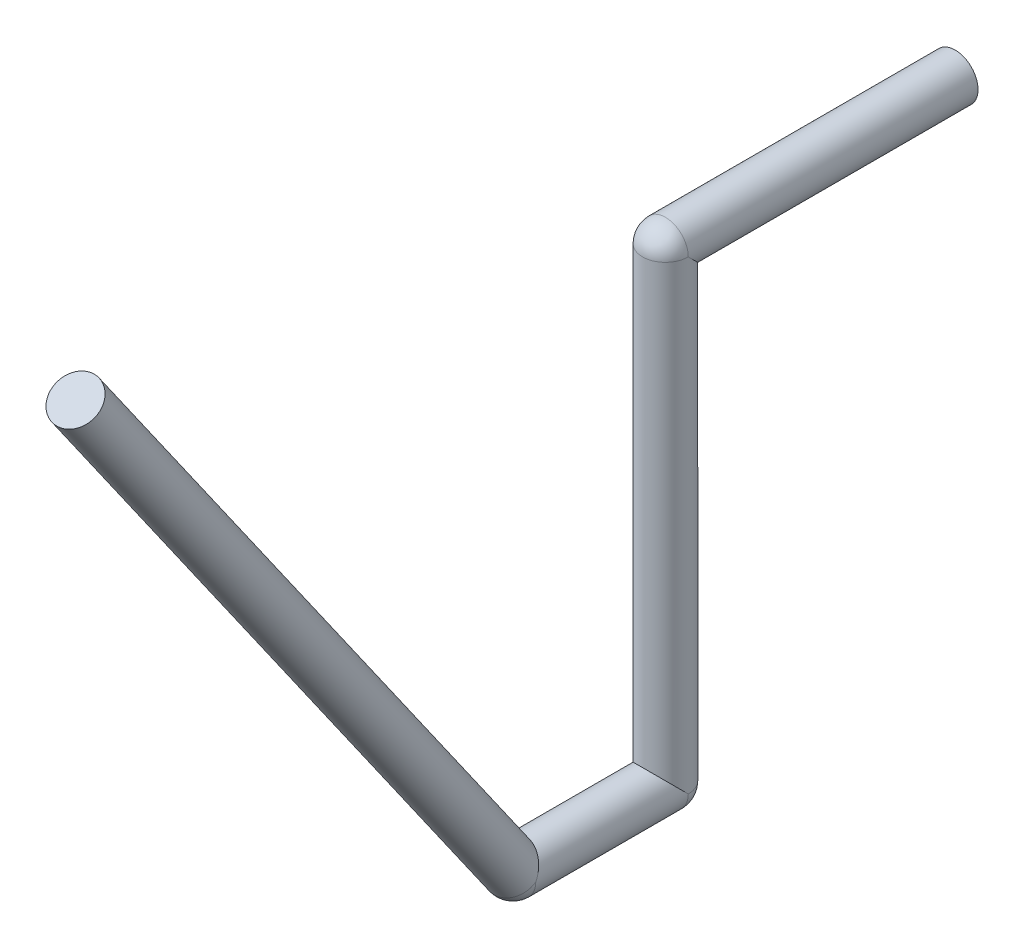
ISO-10303-21;
HEADER;
FILE_DESCRIPTION(('STEP AP214'),'2;1');
FILE_NAME('part.step','',(''),(''),'','','');
FILE_SCHEMA(('AUTOMOTIVE_DESIGN { 1 0 10303 214 1 1 1 1 }'));
ENDSEC;
DATA;
#1=APPLICATION_CONTEXT('core data for automotive mechanical design processes');
#2=APPLICATION_PROTOCOL_DEFINITION('international standard','automotive_design',2000,#1);
#3=PRODUCT_CONTEXT('',#1,'mechanical');
#4=PRODUCT('Part','Part','',(#3));
#5=PRODUCT_RELATED_PRODUCT_CATEGORY('part','',(#4));
#6=PRODUCT_DEFINITION_FORMATION('','',#4);
#7=PRODUCT_DEFINITION_CONTEXT('part definition',#1,'design');
#8=PRODUCT_DEFINITION('design','',#6,#7);
#9=PRODUCT_DEFINITION_SHAPE('','',#8);
#10=(LENGTH_UNIT() NAMED_UNIT(*) SI_UNIT(.MILLI.,.METRE.));
#11=(NAMED_UNIT(*) PLANE_ANGLE_UNIT() SI_UNIT($,.RADIAN.));
#12=(NAMED_UNIT(*) SI_UNIT($,.STERADIAN.) SOLID_ANGLE_UNIT());
#13=UNCERTAINTY_MEASURE_WITH_UNIT(LENGTH_MEASURE(1.E-05),#10,'distance_accuracy_value','');
#14=(GEOMETRIC_REPRESENTATION_CONTEXT(3) GLOBAL_UNCERTAINTY_ASSIGNED_CONTEXT((#13)) GLOBAL_UNIT_ASSIGNED_CONTEXT((#10,
#11,#12)) REPRESENTATION_CONTEXT('',''));
#15=CARTESIAN_POINT('',(0.,0.,0.));
#16=DIRECTION('',(0.,0.,1.));
#17=DIRECTION('',(1.,0.,0.));
#18=AXIS2_PLACEMENT_3D('',#15,#16,#17);
#19=CARTESIAN_POINT('',(0.6,10.4,-2.5));
#20=DIRECTION('',(0.,0.,1.));
#21=DIRECTION('',(1.,0.,0.));
#22=AXIS2_PLACEMENT_3D('',#19,#20,#21);
#23=PLANE('',#22);
#24=CARTESIAN_POINT('',(0.6,10.4,-2.5));
#25=DIRECTION('',(0.,0.,1.));
#26=DIRECTION('',(1.,0.,0.));
#27=AXIS2_PLACEMENT_3D('',#24,#25,#26);
#28=CIRCLE('',#27,0.3);
#29=CARTESIAN_POINT('',(0.3,10.4,-2.5));
#30=VERTEX_POINT('',#29);
#31=EDGE_CURVE('E11',#30,#30,#28,.T.);
#32=ORIENTED_EDGE('',*,*,#31,.F.);
#33=EDGE_LOOP('',(#32));
#34=FACE_BOUND('',#33,.T.);
#35=ADVANCED_FACE('F17',(#34),#23,.F.);
#36=CARTESIAN_POINT('',(0.6,10.4,-2.5));
#37=DIRECTION('',(0.,0.,1.));
#38=DIRECTION('',(1.,0.,0.));
#39=AXIS2_PLACEMENT_3D('',#36,#37,#38);
#40=CYLINDRICAL_SURFACE('',#39,0.3);
#41=CARTESIAN_POINT('',(0.6,10.4,1.3));
#42=DIRECTION('',(0.,-0.707106781186548,0.707106781186548));
#43=DIRECTION('',(0.,0.707106781186548,0.707106781186548));
#44=AXIS2_PLACEMENT_3D('',#41,#42,#43);
#45=ELLIPSE('',#44,0.424264068712,0.3);
#46=CARTESIAN_POINT('',(0.3,10.4,1.3));
#47=VERTEX_POINT('',#46);
#48=CARTESIAN_POINT('',(0.9,10.4,1.3));
#49=VERTEX_POINT('',#48);
#50=EDGE_CURVE('E21',#47,#49,#45,.T.);
#51=ORIENTED_EDGE('',*,*,#50,.F.);
#52=DIRECTION('',(0.,0.,-1.));
#53=VECTOR('',#52,1.);
#54=CARTESIAN_POINT('',(0.3,10.4,-2.5));
#55=LINE('',#54,#53);
#56=EDGE_CURVE('E28',#47,#30,#55,.T.);
#57=ORIENTED_EDGE('',*,*,#56,.T.);
#58=ORIENTED_EDGE('',*,*,#31,.T.);
#59=ORIENTED_EDGE('',*,*,#56,.F.);
#60=CARTESIAN_POINT('',(0.6,10.4,1.3));
#61=DIRECTION('',(0.,0.,1.));
#62=DIRECTION('',(1.,0.,0.));
#63=AXIS2_PLACEMENT_3D('',#60,#61,#62);
#64=CIRCLE('',#63,0.3);
#65=CARTESIAN_POINT('',(0.868328157299975,10.53416407865,1.3));
#66=VERTEX_POINT('',#65);
#67=EDGE_CURVE('E140',#66,#47,#64,.T.);
#68=ORIENTED_EDGE('',*,*,#67,.F.);
#69=CARTESIAN_POINT('',(0.6,10.4,1.3));
#70=DIRECTION('',(0.,0.,1.));
#71=DIRECTION('',(1.,0.,0.));
#72=AXIS2_PLACEMENT_3D('',#69,#70,#71);
#73=CIRCLE('',#72,0.3);
#74=EDGE_CURVE('E146',#49,#66,#73,.T.);
#75=ORIENTED_EDGE('',*,*,#74,.F.);
#76=EDGE_LOOP('',(#51,#57,#58,#59,#68,#75));
#77=FACE_BOUND('',#76,.T.);
#78=ADVANCED_FACE('F193',(#77),#40,.T.);
#79=CARTESIAN_POINT('',(0.6,10.4,1.3));
#80=DIRECTION('',(0.577350269189625,0.577350269189628,0.577350269189625));
#81=DIRECTION('',(-0.707106781186548,0.,0.707106781186548));
#82=AXIS2_PLACEMENT_3D('',#79,#80,#81);
#83=SPHERICAL_SURFACE('',#82,0.3);
#84=CARTESIAN_POINT('',(0.6,10.4,1.3));
#85=DIRECTION('',(0.,-1.,0.));
#86=DIRECTION('',(1.,0.,0.));
#87=AXIS2_PLACEMENT_3D('',#84,#85,#86);
#88=CIRCLE('',#87,0.3);
#89=EDGE_CURVE('E136',#49,#47,#88,.T.);
#90=ORIENTED_EDGE('',*,*,#89,.F.);
#91=ORIENTED_EDGE('',*,*,#74,.T.);
#92=CARTESIAN_POINT('',(0.6,10.4,1.3));
#93=DIRECTION('',(-0.408248290463863,0.816496580927726,-0.408248290463863));
#94=DIRECTION('',(0.707106781186548,0.,-0.707106781186548));
#95=AXIS2_PLACEMENT_3D('',#92,#93,#94);
#96=CIRCLE('',#95,0.3);
#97=CARTESIAN_POINT('',(0.773205080756888,10.5732050807569,1.47320508075689));
#98=VERTEX_POINT('',#97);
#99=EDGE_CURVE('E143',#98,#66,#96,.T.);
#100=ORIENTED_EDGE('',*,*,#99,.F.);
#101=ORIENTED_EDGE('',*,*,#99,.T.);
#102=ORIENTED_EDGE('',*,*,#67,.T.);
#103=EDGE_LOOP('',(#90,#91,#100,#101,#102));
#104=FACE_BOUND('',#103,.T.);
#105=ADVANCED_FACE('F200',(#104),#83,.T.);
#106=CARTESIAN_POINT('',(0.6,10.4,1.3));
#107=DIRECTION('',(0.,-1.,0.));
#108=DIRECTION('',(1.,0.,0.));
#109=AXIS2_PLACEMENT_3D('',#106,#107,#108);
#110=CYLINDRICAL_SURFACE('',#109,0.3);
#111=CARTESIAN_POINT('',(0.6,4.3,1.3));
#112=DIRECTION('',(0.,-1.,0.));
#113=DIRECTION('',(1.,0.,0.));
#114=AXIS2_PLACEMENT_3D('',#111,#112,#113);
#115=CIRCLE('',#114,0.3);
#116=CARTESIAN_POINT('',(0.3,4.3,1.3));
#117=VERTEX_POINT('',#116);
#118=CARTESIAN_POINT('',(0.812132034355964,4.3,1.08786796564404));
#119=VERTEX_POINT('',#118);
#120=EDGE_CURVE('E112',#117,#119,#115,.T.);
#121=ORIENTED_EDGE('',*,*,#120,.F.);
#122=DIRECTION('',(0.,1.,0.));
#123=VECTOR('',#122,1.);
#124=CARTESIAN_POINT('',(0.3,10.4,1.3));
#125=LINE('',#124,#123);
#126=EDGE_CURVE('E106',#117,#47,#125,.T.);
#127=ORIENTED_EDGE('',*,*,#126,.T.);
#128=ORIENTED_EDGE('',*,*,#50,.T.);
#129=ORIENTED_EDGE('',*,*,#89,.T.);
#130=ORIENTED_EDGE('',*,*,#126,.F.);
#131=CARTESIAN_POINT('',(0.6,4.3,1.3));
#132=DIRECTION('',(0.,-0.707106781186548,0.707106781186548));
#133=DIRECTION('',(0.,-0.707106781186548,-0.707106781186548));
#134=AXIS2_PLACEMENT_3D('',#131,#132,#133);
#135=ELLIPSE('',#134,0.424264068712,0.3);
#136=CARTESIAN_POINT('',(0.9,4.3,1.3));
#137=VERTEX_POINT('',#136);
#138=EDGE_CURVE('E107',#137,#117,#135,.T.);
#139=ORIENTED_EDGE('',*,*,#138,.F.);
#140=CARTESIAN_POINT('',(0.6,4.3,1.3));
#141=DIRECTION('',(0.,-1.,0.));
#142=DIRECTION('',(1.,0.,0.));
#143=AXIS2_PLACEMENT_3D('',#140,#141,#142);
#144=CIRCLE('',#143,0.3);
#145=EDGE_CURVE('E98',#119,#137,#144,.T.);
#146=ORIENTED_EDGE('',*,*,#145,.F.);
#147=EDGE_LOOP('',(#121,#127,#128,#129,#130,#139,#146));
#148=FACE_BOUND('',#147,.T.);
#149=ADVANCED_FACE('F108',(#148),#110,.T.);
#150=CARTESIAN_POINT('',(0.6,4.3,1.3));
#151=DIRECTION('',(0.577350269189626,0.577350269189626,0.577350269189626));
#152=DIRECTION('',(-0.707106781186548,0.,0.707106781186548));
#153=AXIS2_PLACEMENT_3D('',#150,#151,#152);
#154=SPHERICAL_SURFACE('',#153,0.3);
#155=ORIENTED_EDGE('',*,*,#120,.T.);
#156=CARTESIAN_POINT('',(0.6,4.3,1.3));
#157=DIRECTION('',(-0.408248290463863,0.816496580927726,-0.408248290463863));
#158=DIRECTION('',(0.707106781186548,0.,-0.707106781186548));
#159=AXIS2_PLACEMENT_3D('',#156,#157,#158);
#160=CIRCLE('',#159,0.3);
#161=CARTESIAN_POINT('',(0.426794919243112,4.12679491924311,1.12679491924311));
#162=VERTEX_POINT('',#161);
#163=EDGE_CURVE('E89',#119,#162,#160,.T.);
#164=ORIENTED_EDGE('',*,*,#163,.T.);
#165=ORIENTED_EDGE('',*,*,#163,.F.);
#166=ORIENTED_EDGE('',*,*,#145,.T.);
#167=CARTESIAN_POINT('',(0.6,4.3,1.3));
#168=DIRECTION('',(0.,0.,1.));
#169=DIRECTION('',(1.,0.,0.));
#170=AXIS2_PLACEMENT_3D('',#167,#168,#169);
#171=CIRCLE('',#170,0.3);
#172=EDGE_CURVE('E104',#117,#137,#171,.T.);
#173=ORIENTED_EDGE('',*,*,#172,.F.);
#174=EDGE_LOOP('',(#155,#164,#165,#166,#173));
#175=FACE_BOUND('',#174,.T.);
#176=ADVANCED_FACE('F102',(#175),#154,.T.);
#177=CARTESIAN_POINT('',(0.6,4.3,1.3));
#178=DIRECTION('',(0.,0.,1.));
#179=DIRECTION('',(1.,0.,0.));
#180=AXIS2_PLACEMENT_3D('',#177,#178,#179);
#181=CYLINDRICAL_SURFACE('',#180,0.3);
#182=CARTESIAN_POINT('',(0.6,4.3,3.3));
#183=DIRECTION('',(0.,0.,1.));
#184=DIRECTION('',(1.,0.,0.));
#185=AXIS2_PLACEMENT_3D('',#182,#183,#184);
#186=CIRCLE('',#185,0.3);
#187=CARTESIAN_POINT('',(0.3,4.3,3.3));
#188=VERTEX_POINT('',#187);
#189=CARTESIAN_POINT('',(0.9,4.3,3.3));
#190=VERTEX_POINT('',#189);
#191=EDGE_CURVE('E60',#188,#190,#186,.T.);
#192=ORIENTED_EDGE('',*,*,#191,.F.);
#193=DIRECTION('',(0.,0.,-1.));
#194=VECTOR('',#193,1.);
#195=CARTESIAN_POINT('',(0.3,4.3,1.3));
#196=LINE('',#195,#194);
#197=EDGE_CURVE('E72',#188,#117,#196,.T.);
#198=ORIENTED_EDGE('',*,*,#197,.T.);
#199=ORIENTED_EDGE('',*,*,#172,.T.);
#200=ORIENTED_EDGE('',*,*,#138,.T.);
#201=ORIENTED_EDGE('',*,*,#197,.F.);
#202=CARTESIAN_POINT('',(0.6,4.3,3.3));
#203=DIRECTION('',(0.,0.461748613235098,0.887010833178188));
#204=DIRECTION('',(0.,-0.887010833178188,0.461748613235098));
#205=AXIS2_PLACEMENT_3D('',#202,#203,#204);
#206=ELLIPSE('',#205,0.33821458406,0.3);
#207=EDGE_CURVE('E167',#190,#188,#206,.T.);
#208=ORIENTED_EDGE('',*,*,#207,.F.);
#209=EDGE_LOOP('',(#192,#198,#199,#200,#201,#208));
#210=FACE_BOUND('',#209,.T.);
#211=ADVANCED_FACE('F19',(#210),#181,.T.);
#212=CARTESIAN_POINT('',(0.6,4.3,3.3));
#213=DIRECTION('',(0.,0.,1.));
#214=DIRECTION('',(1.,0.,0.));
#215=AXIS2_PLACEMENT_3D('',#212,#213,#214);
#216=SPHERICAL_SURFACE('',#215,0.3);
#217=ORIENTED_EDGE('',*,*,#191,.T.);
#218=CARTESIAN_POINT('',(0.6,4.3,3.3));
#219=DIRECTION('',(0.,0.819152044289016,0.573576436351011));
#220=DIRECTION('',(1.,0.,0.));
#221=AXIS2_PLACEMENT_3D('',#218,#219,#220);
#222=CIRCLE('',#221,0.3);
#223=EDGE_CURVE('E162',#188,#190,#222,.T.);
#224=ORIENTED_EDGE('',*,*,#223,.F.);
#225=EDGE_LOOP('',(#217,#224));
#226=FACE_BOUND('',#225,.T.);
#227=ADVANCED_FACE('F181',(#226),#216,.T.);
#228=CARTESIAN_POINT('',(0.6,4.3,3.3));
#229=DIRECTION('',(0.,0.819152044289016,0.573576436351011));
#230=DIRECTION('',(1.,0.,0.));
#231=AXIS2_PLACEMENT_3D('',#228,#229,#230);
#232=CYLINDRICAL_SURFACE('',#231,0.3);
#233=CARTESIAN_POINT('',(0.6,12.49152044289,9.03576436351));
#234=DIRECTION('',(0.,0.819152044289016,0.573576436351011));
#235=DIRECTION('',(1.,0.,0.));
#236=AXIS2_PLACEMENT_3D('',#233,#234,#235);
#237=CIRCLE('',#236,0.3);
#238=CARTESIAN_POINT('',(0.3,12.49152044289,9.03576436351));
#239=VERTEX_POINT('',#238);
#240=EDGE_CURVE('E163',#239,#239,#237,.T.);
#241=ORIENTED_EDGE('',*,*,#240,.F.);
#242=DIRECTION('',(0.,-0.819152044289016,-0.573576436351011));
#243=VECTOR('',#242,1.);
#244=CARTESIAN_POINT('',(0.3,4.3,3.3));
#245=LINE('',#244,#243);
#246=EDGE_CURVE('E158',#239,#188,#245,.T.);
#247=ORIENTED_EDGE('',*,*,#246,.T.);
#248=ORIENTED_EDGE('',*,*,#223,.T.);
#249=ORIENTED_EDGE('',*,*,#207,.T.);
#250=ORIENTED_EDGE('',*,*,#246,.F.);
#251=EDGE_LOOP('',(#241,#247,#248,#249,#250));
#252=FACE_BOUND('',#251,.T.);
#253=ADVANCED_FACE('F180',(#252),#232,.T.);
#254=CARTESIAN_POINT('',(0.6,12.49152044289,9.03576436351));
#255=DIRECTION('',(0.,0.819152044289016,0.573576436351011));
#256=DIRECTION('',(1.,0.,0.));
#257=AXIS2_PLACEMENT_3D('',#254,#255,#256);
#258=PLANE('',#257);
#259=ORIENTED_EDGE('',*,*,#240,.T.);
#260=EDGE_LOOP('',(#259));
#261=FACE_BOUND('',#260,.T.);
#262=ADVANCED_FACE('F178',(#261),#258,.T.);
#263=CLOSED_SHELL('',(#35,#78,#105,#149,#176,#211,#227,#253,#262));
#264=MANIFOLD_SOLID_BREP('B1',#263);
#265=ADVANCED_BREP_SHAPE_REPRESENTATION('',(#18,#264),#14);
#266=SHAPE_DEFINITION_REPRESENTATION(#9,#265);
ENDSEC;
END-ISO-10303-21;
